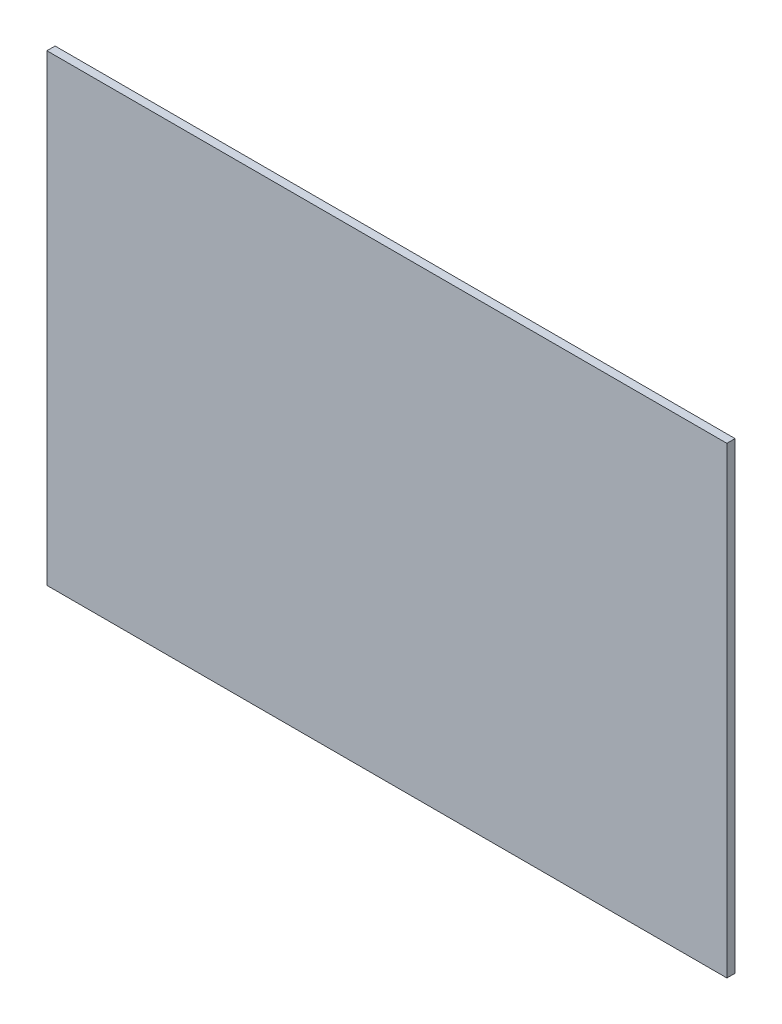
ISO-10303-21;
HEADER;
FILE_DESCRIPTION(('STEP AP214'),'2;1');
FILE_NAME('part.step','',(''),(''),'','','');
FILE_SCHEMA(('AUTOMOTIVE_DESIGN { 1 0 10303 214 1 1 1 1 }'));
ENDSEC;
DATA;
#1=APPLICATION_CONTEXT('core data for automotive mechanical design processes');
#2=APPLICATION_PROTOCOL_DEFINITION('international standard','automotive_design',2000,#1);
#3=PRODUCT_CONTEXT('',#1,'mechanical');
#4=PRODUCT('Part','Part','',(#3));
#5=PRODUCT_RELATED_PRODUCT_CATEGORY('part','',(#4));
#6=PRODUCT_DEFINITION_FORMATION('','',#4);
#7=PRODUCT_DEFINITION_CONTEXT('part definition',#1,'design');
#8=PRODUCT_DEFINITION('design','',#6,#7);
#9=PRODUCT_DEFINITION_SHAPE('','',#8);
#10=(LENGTH_UNIT() NAMED_UNIT(*) SI_UNIT(.MILLI.,.METRE.));
#11=(NAMED_UNIT(*) PLANE_ANGLE_UNIT() SI_UNIT($,.RADIAN.));
#12=(NAMED_UNIT(*) SI_UNIT($,.STERADIAN.) SOLID_ANGLE_UNIT());
#13=UNCERTAINTY_MEASURE_WITH_UNIT(LENGTH_MEASURE(1.E-05),#10,'distance_accuracy_value','');
#14=(GEOMETRIC_REPRESENTATION_CONTEXT(3) GLOBAL_UNCERTAINTY_ASSIGNED_CONTEXT((#13)) GLOBAL_UNIT_ASSIGNED_CONTEXT((#10,
#11,#12)) REPRESENTATION_CONTEXT('',''));
#15=CARTESIAN_POINT('',(0.,0.,0.));
#16=DIRECTION('',(0.,0.,1.));
#17=DIRECTION('',(1.,0.,0.));
#18=AXIS2_PLACEMENT_3D('',#15,#16,#17);
#19=CARTESIAN_POINT('',(4.15,0.67601,0.05));
#20=DIRECTION('',(-1.,0.,0.));
#21=DIRECTION('',(0.,0.,1.));
#22=AXIS2_PLACEMENT_3D('',#19,#20,#21);
#23=PLANE('',#22);
#24=DIRECTION('',(0.,0.,-1.));
#25=VECTOR('',#24,1.);
#26=CARTESIAN_POINT('',(4.15,-2.15,0.05));
#27=LINE('',#26,#25);
#28=CARTESIAN_POINT('',(4.15,-2.15,0.1));
#29=VERTEX_POINT('',#28);
#30=CARTESIAN_POINT('',(4.15,-2.15,0.));
#31=VERTEX_POINT('',#30);
#32=EDGE_CURVE('E81',#29,#31,#27,.T.);
#33=ORIENTED_EDGE('',*,*,#32,.T.);
#34=DIRECTION('',(0.,-1.,0.));
#35=VECTOR('',#34,1.);
#36=CARTESIAN_POINT('',(4.15,0.67601,0.));
#37=LINE('',#36,#35);
#38=CARTESIAN_POINT('',(4.15,3.50202,0.));
#39=VERTEX_POINT('',#38);
#40=EDGE_CURVE('E116',#39,#31,#37,.T.);
#41=ORIENTED_EDGE('',*,*,#40,.F.);
#42=DIRECTION('',(0.,0.,-1.));
#43=VECTOR('',#42,1.);
#44=CARTESIAN_POINT('',(4.15,3.50202,0.05));
#45=LINE('',#44,#43);
#46=CARTESIAN_POINT('',(4.15,3.50202,0.1));
#47=VERTEX_POINT('',#46);
#48=EDGE_CURVE('E11',#47,#39,#45,.T.);
#49=ORIENTED_EDGE('',*,*,#48,.F.);
#50=DIRECTION('',(0.,1.,0.));
#51=VECTOR('',#50,1.);
#52=CARTESIAN_POINT('',(4.15,0.67601,0.1));
#53=LINE('',#52,#51);
#54=EDGE_CURVE('E93',#29,#47,#53,.T.);
#55=ORIENTED_EDGE('',*,*,#54,.F.);
#56=EDGE_LOOP('',(#33,#41,#49,#55));
#57=FACE_BOUND('',#56,.T.);
#58=ADVANCED_FACE('F16',(#57),#23,.F.);
#59=CARTESIAN_POINT('',(0.,3.50202,0.05));
#60=DIRECTION('',(0.,-1.,0.));
#61=DIRECTION('',(0.,0.,-1.));
#62=AXIS2_PLACEMENT_3D('',#59,#60,#61);
#63=PLANE('',#62);
#64=ORIENTED_EDGE('',*,*,#48,.T.);
#65=DIRECTION('',(1.,0.,0.));
#66=VECTOR('',#65,1.);
#67=CARTESIAN_POINT('',(0.,3.50202,0.));
#68=LINE('',#67,#66);
#69=CARTESIAN_POINT('',(-4.15,3.50202,0.));
#70=VERTEX_POINT('',#69);
#71=EDGE_CURVE('E78',#70,#39,#68,.T.);
#72=ORIENTED_EDGE('',*,*,#71,.F.);
#73=DIRECTION('',(0.,0.,-1.));
#74=VECTOR('',#73,1.);
#75=CARTESIAN_POINT('',(-4.15,3.50202,0.05));
#76=LINE('',#75,#74);
#77=CARTESIAN_POINT('',(-4.15,3.50202,0.1));
#78=VERTEX_POINT('',#77);
#79=EDGE_CURVE('E26',#78,#70,#76,.T.);
#80=ORIENTED_EDGE('',*,*,#79,.F.);
#81=DIRECTION('',(-1.,0.,0.));
#82=VECTOR('',#81,1.);
#83=CARTESIAN_POINT('',(0.,3.50202,0.1));
#84=LINE('',#83,#82);
#85=EDGE_CURVE('E75',#47,#78,#84,.T.);
#86=ORIENTED_EDGE('',*,*,#85,.F.);
#87=EDGE_LOOP('',(#64,#72,#80,#86));
#88=FACE_BOUND('',#87,.T.);
#89=ADVANCED_FACE('F73',(#88),#63,.F.);
#90=CARTESIAN_POINT('',(-4.15,0.67601,0.05));
#91=DIRECTION('',(1.,0.,0.));
#92=DIRECTION('',(0.,1.,0.));
#93=AXIS2_PLACEMENT_3D('',#90,#91,#92);
#94=PLANE('',#93);
#95=ORIENTED_EDGE('',*,*,#79,.T.);
#96=DIRECTION('',(0.,1.,0.));
#97=VECTOR('',#96,1.);
#98=CARTESIAN_POINT('',(-4.15,0.67601,0.));
#99=LINE('',#98,#97);
#100=CARTESIAN_POINT('',(-4.15,-2.15,0.));
#101=VERTEX_POINT('',#100);
#102=EDGE_CURVE('E104',#101,#70,#99,.T.);
#103=ORIENTED_EDGE('',*,*,#102,.F.);
#104=DIRECTION('',(0.,0.,-1.));
#105=VECTOR('',#104,1.);
#106=CARTESIAN_POINT('',(-4.15,-2.15,0.05));
#107=LINE('',#106,#105);
#108=CARTESIAN_POINT('',(-4.15,-2.15,0.1));
#109=VERTEX_POINT('',#108);
#110=EDGE_CURVE('E51',#109,#101,#107,.T.);
#111=ORIENTED_EDGE('',*,*,#110,.F.);
#112=DIRECTION('',(0.,-1.,0.));
#113=VECTOR('',#112,1.);
#114=CARTESIAN_POINT('',(-4.15,0.67601,0.1));
#115=LINE('',#114,#113);
#116=EDGE_CURVE('E84',#78,#109,#115,.T.);
#117=ORIENTED_EDGE('',*,*,#116,.F.);
#118=EDGE_LOOP('',(#95,#103,#111,#117));
#119=FACE_BOUND('',#118,.T.);
#120=ADVANCED_FACE('F85',(#119),#94,.F.);
#121=CARTESIAN_POINT('',(0.,-2.15,0.05));
#122=DIRECTION('',(0.,1.,0.));
#123=DIRECTION('',(1.,0.,0.));
#124=AXIS2_PLACEMENT_3D('',#121,#122,#123);
#125=PLANE('',#124);
#126=ORIENTED_EDGE('',*,*,#110,.T.);
#127=DIRECTION('',(-1.,0.,0.));
#128=VECTOR('',#127,1.);
#129=CARTESIAN_POINT('',(0.,-2.15,0.));
#130=LINE('',#129,#128);
#131=EDGE_CURVE('E20',#31,#101,#130,.T.);
#132=ORIENTED_EDGE('',*,*,#131,.F.);
#133=ORIENTED_EDGE('',*,*,#32,.F.);
#134=DIRECTION('',(1.,0.,0.));
#135=VECTOR('',#134,1.);
#136=CARTESIAN_POINT('',(0.,-2.15,0.1));
#137=LINE('',#136,#135);
#138=EDGE_CURVE('E89',#109,#29,#137,.T.);
#139=ORIENTED_EDGE('',*,*,#138,.F.);
#140=EDGE_LOOP('',(#126,#132,#133,#139));
#141=FACE_BOUND('',#140,.T.);
#142=ADVANCED_FACE('F126',(#141),#125,.F.);
#143=CARTESIAN_POINT('',(0.,0.67601,0.));
#144=DIRECTION('',(0.,0.,1.));
#145=DIRECTION('',(1.,0.,0.));
#146=AXIS2_PLACEMENT_3D('',#143,#144,#145);
#147=PLANE('',#146);
#148=ORIENTED_EDGE('',*,*,#40,.T.);
#149=ORIENTED_EDGE('',*,*,#131,.T.);
#150=ORIENTED_EDGE('',*,*,#102,.T.);
#151=ORIENTED_EDGE('',*,*,#71,.T.);
#152=EDGE_LOOP('',(#148,#149,#150,#151));
#153=FACE_BOUND('',#152,.T.);
#154=ADVANCED_FACE('F18',(#153),#147,.F.);
#155=CARTESIAN_POINT('',(0.,0.67601,0.1));
#156=DIRECTION('',(0.,0.,1.));
#157=DIRECTION('',(1.,0.,0.));
#158=AXIS2_PLACEMENT_3D('',#155,#156,#157);
#159=PLANE('',#158);
#160=ORIENTED_EDGE('',*,*,#54,.T.);
#161=ORIENTED_EDGE('',*,*,#85,.T.);
#162=ORIENTED_EDGE('',*,*,#116,.T.);
#163=ORIENTED_EDGE('',*,*,#138,.T.);
#164=EDGE_LOOP('',(#160,#161,#162,#163));
#165=FACE_BOUND('',#164,.T.);
#166=ADVANCED_FACE('F91',(#165),#159,.T.);
#167=CLOSED_SHELL('',(#58,#89,#120,#142,#154,#166));
#168=MANIFOLD_SOLID_BREP('B1',#167);
#169=ADVANCED_BREP_SHAPE_REPRESENTATION('',(#18,#168),#14);
#170=SHAPE_DEFINITION_REPRESENTATION(#9,#169);
ENDSEC;
END-ISO-10303-21;
